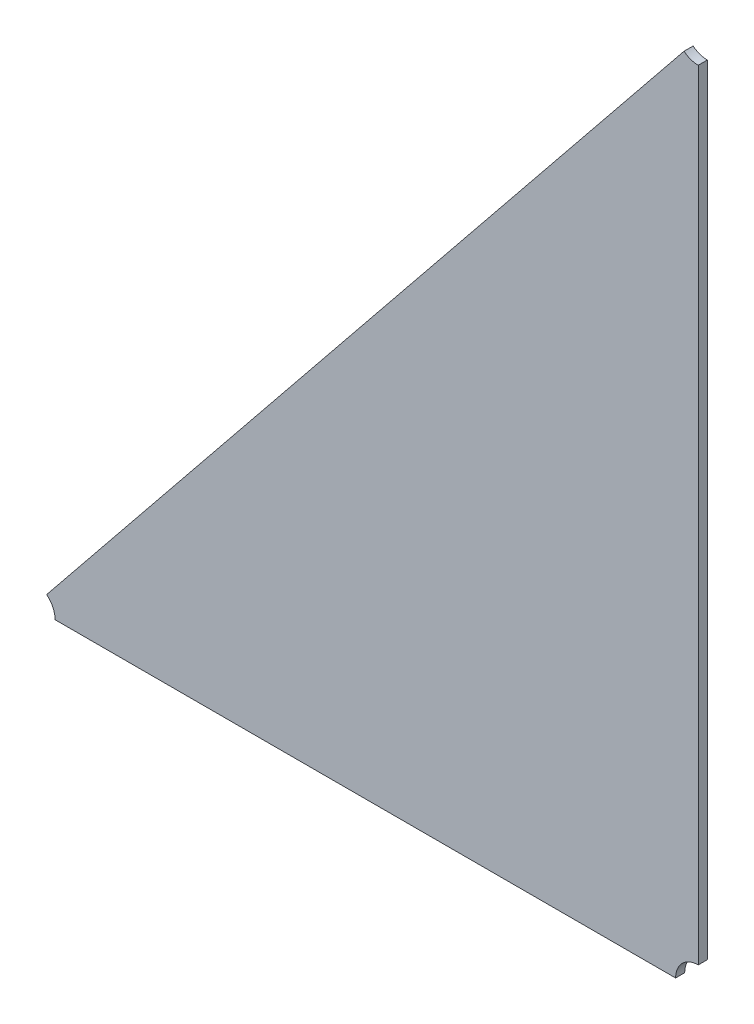
ISO-10303-21;
HEADER;
FILE_DESCRIPTION(('STEP AP214'),'2;1');
FILE_NAME('part.step','',(''),(''),'','','');
FILE_SCHEMA(('AUTOMOTIVE_DESIGN { 1 0 10303 214 1 1 1 1 }'));
ENDSEC;
DATA;
#1=APPLICATION_CONTEXT('core data for automotive mechanical design processes');
#2=APPLICATION_PROTOCOL_DEFINITION('international standard','automotive_design',2000,#1);
#3=PRODUCT_CONTEXT('',#1,'mechanical');
#4=PRODUCT('Part','Part','',(#3));
#5=PRODUCT_RELATED_PRODUCT_CATEGORY('part','',(#4));
#6=PRODUCT_DEFINITION_FORMATION('','',#4);
#7=PRODUCT_DEFINITION_CONTEXT('part definition',#1,'design');
#8=PRODUCT_DEFINITION('design','',#6,#7);
#9=PRODUCT_DEFINITION_SHAPE('','',#8);
#10=(LENGTH_UNIT() NAMED_UNIT(*) SI_UNIT(.MILLI.,.METRE.));
#11=(NAMED_UNIT(*) PLANE_ANGLE_UNIT() SI_UNIT($,.RADIAN.));
#12=(NAMED_UNIT(*) SI_UNIT($,.STERADIAN.) SOLID_ANGLE_UNIT());
#13=UNCERTAINTY_MEASURE_WITH_UNIT(LENGTH_MEASURE(1.E-05),#10,'distance_accuracy_value','');
#14=(GEOMETRIC_REPRESENTATION_CONTEXT(3) GLOBAL_UNCERTAINTY_ASSIGNED_CONTEXT((#13)) GLOBAL_UNIT_ASSIGNED_CONTEXT((#10,
#11,#12)) REPRESENTATION_CONTEXT('',''));
#15=CARTESIAN_POINT('',(0.,0.,0.));
#16=DIRECTION('',(0.,0.,1.));
#17=DIRECTION('',(1.,0.,0.));
#18=AXIS2_PLACEMENT_3D('',#15,#16,#17);
#19=CARTESIAN_POINT('',(-1.84866705041206,-1.2265091946304,0.002));
#20=DIRECTION('',(0.,0.,1.));
#21=DIRECTION('',(-1.,0.,0.));
#22=AXIS2_PLACEMENT_3D('',#19,#20,#21);
#23=CYLINDRICAL_SURFACE('',#22,0.00499999999999994);
#24=DIRECTION('',(-1.11022302462516E-13,0.,1.));
#25=VECTOR('',#24,1.);
#26=CARTESIAN_POINT('',(-1.84552560436981,-1.22261929530476,0.));
#27=LINE('',#26,#25);
#28=CARTESIAN_POINT('',(-1.84552560436981,-1.22261929530476,0.));
#29=VERTEX_POINT('',#28);
#30=CARTESIAN_POINT('',(-1.84552560436981,-1.22261929530476,0.002));
#31=VERTEX_POINT('',#30);
#32=EDGE_CURVE('E11',#29,#31,#27,.T.);
#33=ORIENTED_EDGE('',*,*,#32,.F.);
#34=CARTESIAN_POINT('',(-1.84866705041206,-1.2265091946304,0.));
#35=DIRECTION('',(0.,0.,1.));
#36=DIRECTION('',(1.,0.,0.));
#37=AXIS2_PLACEMENT_3D('',#34,#35,#36);
#38=CIRCLE('',#37,0.00499999999999994);
#39=CARTESIAN_POINT('',(-1.84366705041206,-1.2265091946304,0.));
#40=VERTEX_POINT('',#39);
#41=EDGE_CURVE('E72',#40,#29,#38,.T.);
#42=ORIENTED_EDGE('',*,*,#41,.F.);
#43=DIRECTION('',(0.,0.,-1.));
#44=VECTOR('',#43,1.);
#45=CARTESIAN_POINT('',(-1.84366705041206,-1.2265091946304,0.002));
#46=LINE('',#45,#44);
#47=CARTESIAN_POINT('',(-1.84366705041206,-1.2265091946304,0.002));
#48=VERTEX_POINT('',#47);
#49=EDGE_CURVE('E94',#48,#40,#46,.T.);
#50=ORIENTED_EDGE('',*,*,#49,.F.);
#51=CARTESIAN_POINT('',(-1.84866705041206,-1.2265091946304,0.002));
#52=DIRECTION('',(0.,0.,-1.));
#53=DIRECTION('',(0.628289208450233,0.777979865128256,0.));
#54=AXIS2_PLACEMENT_3D('',#51,#52,#53);
#55=CIRCLE('',#54,0.00499999999999994);
#56=EDGE_CURVE('E112',#31,#48,#55,.T.);
#57=ORIENTED_EDGE('',*,*,#56,.F.);
#58=EDGE_LOOP('',(#33,#42,#50,#57));
#59=FACE_BOUND('',#58,.T.);
#60=ADVANCED_FACE('F17',(#59),#23,.F.);
#61=CARTESIAN_POINT('',(-1.7016489577392,-1.2265091946304,0.002));
#62=DIRECTION('',(0.,0.,1.));
#63=DIRECTION('',(-1.,0.,0.));
#64=AXIS2_PLACEMENT_3D('',#61,#62,#63);
#65=CYLINDRICAL_SURFACE('',#64,0.00499999999999999);
#66=DIRECTION('',(0.,0.,-1.));
#67=VECTOR('',#66,1.);
#68=CARTESIAN_POINT('',(-1.7016489577392,-1.2215091946304,0.002));
#69=LINE('',#68,#67);
#70=CARTESIAN_POINT('',(-1.7016489577392,-1.2215091946304,0.002));
#71=VERTEX_POINT('',#70);
#72=CARTESIAN_POINT('',(-1.7016489577392,-1.2215091946304,0.));
#73=VERTEX_POINT('',#72);
#74=EDGE_CURVE('E24',#71,#73,#69,.T.);
#75=ORIENTED_EDGE('',*,*,#74,.F.);
#76=CARTESIAN_POINT('',(-1.7016489577392,-1.2265091946304,0.002));
#77=DIRECTION('',(0.,0.,-1.));
#78=DIRECTION('',(-1.,0.,0.));
#79=AXIS2_PLACEMENT_3D('',#76,#77,#78);
#80=CIRCLE('',#79,0.00499999999999999);
#81=CARTESIAN_POINT('',(-1.7066489577392,-1.2265091946304,0.002));
#82=VERTEX_POINT('',#81);
#83=EDGE_CURVE('E90',#82,#71,#80,.T.);
#84=ORIENTED_EDGE('',*,*,#83,.F.);
#85=DIRECTION('',(0.,0.,1.));
#86=VECTOR('',#85,1.);
#87=CARTESIAN_POINT('',(-1.7066489577392,-1.2265091946304,0.));
#88=LINE('',#87,#86);
#89=CARTESIAN_POINT('',(-1.7066489577392,-1.2265091946304,0.));
#90=VERTEX_POINT('',#89);
#91=EDGE_CURVE('E115',#90,#82,#88,.T.);
#92=ORIENTED_EDGE('',*,*,#91,.F.);
#93=CARTESIAN_POINT('',(-1.7016489577392,-1.2265091946304,0.));
#94=DIRECTION('',(0.,0.,1.));
#95=DIRECTION('',(0.,1.,0.));
#96=AXIS2_PLACEMENT_3D('',#93,#94,#95);
#97=CIRCLE('',#96,0.00499999999999999);
#98=EDGE_CURVE('E75',#73,#90,#97,.T.);
#99=ORIENTED_EDGE('',*,*,#98,.F.);
#100=EDGE_LOOP('',(#75,#84,#92,#99));
#101=FACE_BOUND('',#100,.T.);
#102=ADVANCED_FACE('F127',(#101),#65,.F.);
#103=CARTESIAN_POINT('',(-1.7016489577392,-1.04446386523316,0.002));
#104=DIRECTION('',(0.,0.,1.));
#105=DIRECTION('',(-1.,0.,0.));
#106=AXIS2_PLACEMENT_3D('',#103,#104,#105);
#107=CYLINDRICAL_SURFACE('',#106,0.00499999999999997);
#108=DIRECTION('',(0.,0.,-1.));
#109=VECTOR('',#108,1.);
#110=CARTESIAN_POINT('',(-1.70479040378145,-1.0483537645588,0.002));
#111=LINE('',#110,#109);
#112=CARTESIAN_POINT('',(-1.70479040378145,-1.0483537645588,0.002));
#113=VERTEX_POINT('',#112);
#114=CARTESIAN_POINT('',(-1.70479040378145,-1.0483537645588,0.));
#115=VERTEX_POINT('',#114);
#116=EDGE_CURVE('E79',#113,#115,#111,.T.);
#117=ORIENTED_EDGE('',*,*,#116,.F.);
#118=CARTESIAN_POINT('',(-1.7016489577392,-1.04446386523316,0.002));
#119=DIRECTION('',(0.,0.,-1.));
#120=DIRECTION('',(0.,-1.,0.));
#121=AXIS2_PLACEMENT_3D('',#118,#119,#120);
#122=CIRCLE('',#121,0.00499999999999997);
#123=CARTESIAN_POINT('',(-1.7016489577392,-1.04946386523316,0.002));
#124=VERTEX_POINT('',#123);
#125=EDGE_CURVE('E118',#124,#113,#122,.T.);
#126=ORIENTED_EDGE('',*,*,#125,.F.);
#127=DIRECTION('',(0.,-1.11022302462516E-13,1.));
#128=VECTOR('',#127,1.);
#129=CARTESIAN_POINT('',(-1.7016489577392,-1.04946386523316,0.));
#130=LINE('',#129,#128);
#131=CARTESIAN_POINT('',(-1.7016489577392,-1.04946386523316,0.));
#132=VERTEX_POINT('',#131);
#133=EDGE_CURVE('E82',#132,#124,#130,.T.);
#134=ORIENTED_EDGE('',*,*,#133,.F.);
#135=CARTESIAN_POINT('',(-1.7016489577392,-1.04446386523316,0.));
#136=DIRECTION('',(0.,0.,1.));
#137=DIRECTION('',(-0.628289208450233,-0.777979865128256,0.));
#138=AXIS2_PLACEMENT_3D('',#135,#136,#137);
#139=CIRCLE('',#138,0.00499999999999997);
#140=EDGE_CURVE('E70',#115,#132,#139,.T.);
#141=ORIENTED_EDGE('',*,*,#140,.F.);
#142=EDGE_LOOP('',(#117,#126,#134,#141));
#143=FACE_BOUND('',#142,.T.);
#144=ADVANCED_FACE('F78',(#143),#107,.F.);
#145=CARTESIAN_POINT('',(-1.7016489577392,-1.2265091946304,0.));
#146=DIRECTION('',(0.,1.,0.));
#147=DIRECTION('',(-1.,0.,0.));
#148=AXIS2_PLACEMENT_3D('',#145,#146,#147);
#149=PLANE('',#148);
#150=ORIENTED_EDGE('',*,*,#49,.T.);
#151=DIRECTION('',(-1.,0.,0.));
#152=VECTOR('',#151,1.);
#153=CARTESIAN_POINT('',(-1.7066489577392,-1.2265091946304,0.));
#154=LINE('',#153,#152);
#155=EDGE_CURVE('E110',#90,#40,#154,.T.);
#156=ORIENTED_EDGE('',*,*,#155,.F.);
#157=ORIENTED_EDGE('',*,*,#91,.T.);
#158=DIRECTION('',(-1.,0.,0.));
#159=VECTOR('',#158,1.);
#160=CARTESIAN_POINT('',(-1.7066489577392,-1.2265091946304,0.002));
#161=LINE('',#160,#159);
#162=EDGE_CURVE('E102',#82,#48,#161,.T.);
#163=ORIENTED_EDGE('',*,*,#162,.T.);
#164=EDGE_LOOP('',(#150,#156,#157,#163));
#165=FACE_BOUND('',#164,.T.);
#166=ADVANCED_FACE('F122',(#165),#149,.F.);
#167=CARTESIAN_POINT('',(-1.75139151902935,-1.15925301497806,0.));
#168=DIRECTION('',(0.,0.,-1.));
#169=DIRECTION('',(-1.,0.,0.));
#170=AXIS2_PLACEMENT_3D('',#167,#168,#169);
#171=PLANE('',#170);
#172=ORIENTED_EDGE('',*,*,#41,.T.);
#173=DIRECTION('',(0.628289208450209,0.777979865128276,0.));
#174=VECTOR('',#173,1.);
#175=CARTESIAN_POINT('',(-1.84552560436981,-1.22261929530476,0.));
#176=LINE('',#175,#174);
#177=EDGE_CURVE('E66',#29,#115,#176,.T.);
#178=ORIENTED_EDGE('',*,*,#177,.T.);
#179=ORIENTED_EDGE('',*,*,#140,.T.);
#180=DIRECTION('',(0.,-1.,0.));
#181=VECTOR('',#180,1.);
#182=CARTESIAN_POINT('',(-1.7016489577392,-1.04946386523316,0.));
#183=LINE('',#182,#181);
#184=EDGE_CURVE('E84',#132,#73,#183,.T.);
#185=ORIENTED_EDGE('',*,*,#184,.T.);
#186=ORIENTED_EDGE('',*,*,#98,.T.);
#187=ORIENTED_EDGE('',*,*,#155,.T.);
#188=EDGE_LOOP('',(#172,#178,#179,#185,#186,#187));
#189=FACE_BOUND('',#188,.T.);
#190=ADVANCED_FACE('F68',(#189),#171,.T.);
#191=CARTESIAN_POINT('',(-1.7016489577392,-1.04446386523316,0.));
#192=DIRECTION('',(-1.,0.,0.));
#193=DIRECTION('',(0.,-1.,0.));
#194=AXIS2_PLACEMENT_3D('',#191,#192,#193);
#195=PLANE('',#194);
#196=ORIENTED_EDGE('',*,*,#74,.T.);
#197=ORIENTED_EDGE('',*,*,#184,.F.);
#198=ORIENTED_EDGE('',*,*,#133,.T.);
#199=DIRECTION('',(0.,-1.,0.));
#200=VECTOR('',#199,1.);
#201=CARTESIAN_POINT('',(-1.7016489577392,-1.04946386523316,0.002));
#202=LINE('',#201,#200);
#203=EDGE_CURVE('E100',#124,#71,#202,.T.);
#204=ORIENTED_EDGE('',*,*,#203,.T.);
#205=EDGE_LOOP('',(#196,#197,#198,#204));
#206=FACE_BOUND('',#205,.T.);
#207=ADVANCED_FACE('F98',(#206),#195,.F.);
#208=CARTESIAN_POINT('',(-1.84866705041206,-1.2265091946304,0.));
#209=DIRECTION('',(0.777979865128275,-0.628289208450209,0.));
#210=DIRECTION('',(0.628289208450209,0.777979865128275,0.));
#211=AXIS2_PLACEMENT_3D('',#208,#209,#210);
#212=PLANE('',#211);
#213=ORIENTED_EDGE('',*,*,#32,.T.);
#214=DIRECTION('',(0.628289208450209,0.777979865128276,0.));
#215=VECTOR('',#214,1.);
#216=CARTESIAN_POINT('',(-1.84552560436981,-1.22261929530476,0.002));
#217=LINE('',#216,#215);
#218=EDGE_CURVE('E88',#31,#113,#217,.T.);
#219=ORIENTED_EDGE('',*,*,#218,.T.);
#220=ORIENTED_EDGE('',*,*,#116,.T.);
#221=ORIENTED_EDGE('',*,*,#177,.F.);
#222=EDGE_LOOP('',(#213,#219,#220,#221));
#223=FACE_BOUND('',#222,.T.);
#224=ADVANCED_FACE('F86',(#223),#212,.F.);
#225=CARTESIAN_POINT('',(-1.75139151902935,-1.15925301497806,0.002));
#226=DIRECTION('',(0.,0.,-1.));
#227=DIRECTION('',(-1.,0.,0.));
#228=AXIS2_PLACEMENT_3D('',#225,#226,#227);
#229=PLANE('',#228);
#230=ORIENTED_EDGE('',*,*,#56,.T.);
#231=ORIENTED_EDGE('',*,*,#162,.F.);
#232=ORIENTED_EDGE('',*,*,#83,.T.);
#233=ORIENTED_EDGE('',*,*,#203,.F.);
#234=ORIENTED_EDGE('',*,*,#125,.T.);
#235=ORIENTED_EDGE('',*,*,#218,.F.);
#236=EDGE_LOOP('',(#230,#231,#232,#233,#234,#235));
#237=FACE_BOUND('',#236,.T.);
#238=ADVANCED_FACE('F125',(#237),#229,.F.);
#239=CLOSED_SHELL('',(#60,#102,#144,#166,#190,#207,#224,#238));
#240=MANIFOLD_SOLID_BREP('B1',#239);
#241=ADVANCED_BREP_SHAPE_REPRESENTATION('',(#18,#240),#14);
#242=SHAPE_DEFINITION_REPRESENTATION(#9,#241);
ENDSEC;
END-ISO-10303-21;
